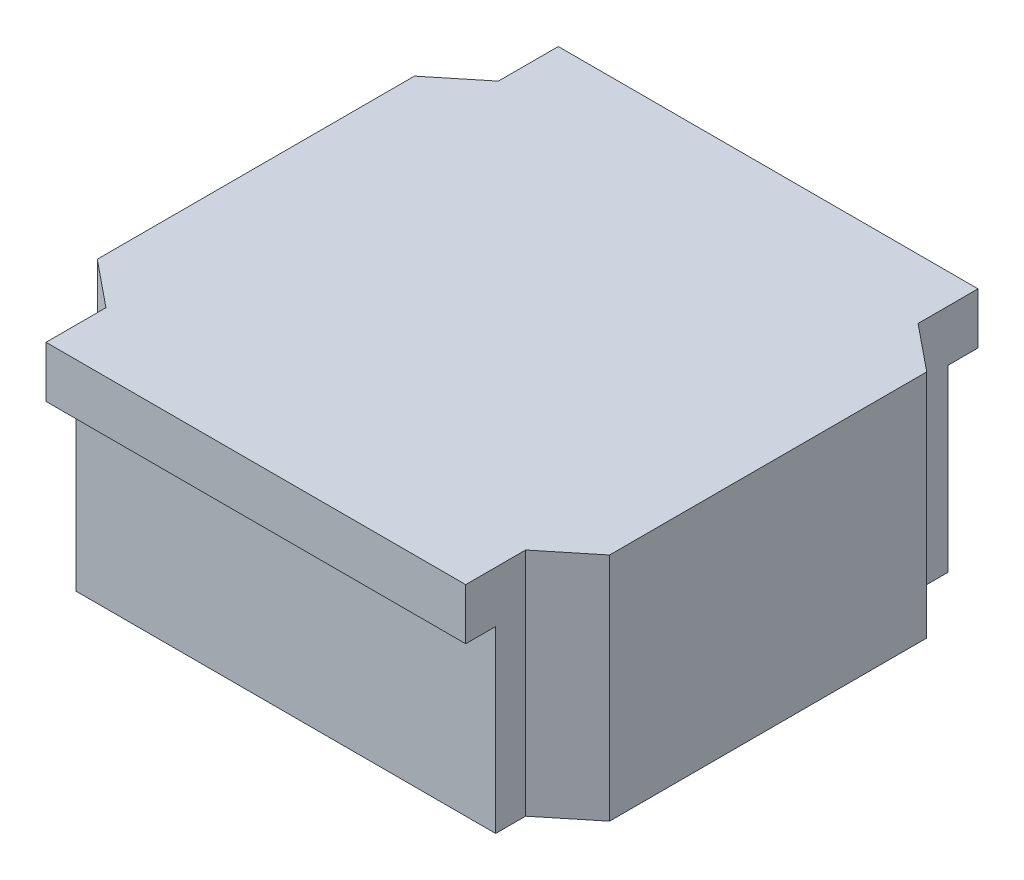
ISO-10303-21;
HEADER;
FILE_DESCRIPTION(('STEP AP214'),'2;1');
FILE_NAME('part.step','',(''),(''),'','','');
FILE_SCHEMA(('AUTOMOTIVE_DESIGN { 1 0 10303 214 1 1 1 1 }'));
ENDSEC;
DATA;
#1=APPLICATION_CONTEXT('core data for automotive mechanical design processes');
#2=APPLICATION_PROTOCOL_DEFINITION('international standard','automotive_design',2000,#1);
#3=PRODUCT_CONTEXT('',#1,'mechanical');
#4=PRODUCT('Part','Part','',(#3));
#5=PRODUCT_RELATED_PRODUCT_CATEGORY('part','',(#4));
#6=PRODUCT_DEFINITION_FORMATION('','',#4);
#7=PRODUCT_DEFINITION_CONTEXT('part definition',#1,'design');
#8=PRODUCT_DEFINITION('design','',#6,#7);
#9=PRODUCT_DEFINITION_SHAPE('','',#8);
#10=(LENGTH_UNIT() NAMED_UNIT(*) SI_UNIT(.MILLI.,.METRE.));
#11=(NAMED_UNIT(*) PLANE_ANGLE_UNIT() SI_UNIT($,.RADIAN.));
#12=(NAMED_UNIT(*) SI_UNIT($,.STERADIAN.) SOLID_ANGLE_UNIT());
#13=UNCERTAINTY_MEASURE_WITH_UNIT(LENGTH_MEASURE(1.E-05),#10,'distance_accuracy_value','');
#14=(GEOMETRIC_REPRESENTATION_CONTEXT(3) GLOBAL_UNCERTAINTY_ASSIGNED_CONTEXT((#13)) GLOBAL_UNIT_ASSIGNED_CONTEXT((#10,
#11,#12)) REPRESENTATION_CONTEXT('',''));
#15=CARTESIAN_POINT('',(0.,0.,0.));
#16=DIRECTION('',(0.,0.,1.));
#17=DIRECTION('',(1.,0.,0.));
#18=AXIS2_PLACEMENT_3D('',#15,#16,#17);
#19=CARTESIAN_POINT('',(0.9614537832608,7.75,-16.78101088067));
#20=DIRECTION('',(1.,0.,0.));
#21=DIRECTION('',(0.,0.,1.));
#22=AXIS2_PLACEMENT_3D('',#19,#20,#21);
#23=PLANE('',#22);
#24=DIRECTION('',(0.,0.,1.));
#25=VECTOR('',#24,1.);
#26=CARTESIAN_POINT('',(0.9614537832608,7.75,-16.547005440335));
#27=LINE('',#26,#25);
#28=CARTESIAN_POINT('',(0.96145378326085,7.75,-16.78101088067));
#29=VERTEX_POINT('',#28);
#30=CARTESIAN_POINT('',(0.96145378326085,7.75,-16.313));
#31=VERTEX_POINT('',#30);
#32=EDGE_CURVE('E248',#29,#31,#27,.T.);
#33=ORIENTED_EDGE('',*,*,#32,.F.);
#34=DIRECTION('',(0.,-1.,0.));
#35=VECTOR('',#34,1.);
#36=CARTESIAN_POINT('',(0.9614537832608,6.85,-16.78101088067));
#37=LINE('',#36,#35);
#38=CARTESIAN_POINT('',(0.9614537832608,5.95,-16.7810108806722));
#39=VERTEX_POINT('',#38);
#40=EDGE_CURVE('E159',#29,#39,#37,.T.);
#41=ORIENTED_EDGE('',*,*,#40,.T.);
#42=DIRECTION('',(0.,0.,-1.));
#43=VECTOR('',#42,1.);
#44=CARTESIAN_POINT('',(0.9614537832608,5.95,-16.547005440335));
#45=LINE('',#44,#43);
#46=CARTESIAN_POINT('',(0.96145378326085,5.95,-16.5470054403375));
#47=VERTEX_POINT('',#46);
#48=EDGE_CURVE('E251',#47,#39,#45,.T.);
#49=ORIENTED_EDGE('',*,*,#48,.F.);
#50=DIRECTION('',(0.,-1.,0.));
#51=VECTOR('',#50,1.);
#52=CARTESIAN_POINT('',(0.9614537832608,6.65,-16.54700544034));
#53=LINE('',#52,#51);
#54=CARTESIAN_POINT('',(0.9614537832608,7.35,-16.5470054403362));
#55=VERTEX_POINT('',#54);
#56=EDGE_CURVE('E221',#55,#47,#53,.T.);
#57=ORIENTED_EDGE('',*,*,#56,.F.);
#58=DIRECTION('',(0.,0.,-1.));
#59=VECTOR('',#58,1.);
#60=CARTESIAN_POINT('',(0.9614537832608,7.35,-16.547005440335));
#61=LINE('',#60,#59);
#62=CARTESIAN_POINT('',(0.9614537832608,7.35,-16.313));
#63=VERTEX_POINT('',#62);
#64=EDGE_CURVE('E252',#63,#55,#61,.T.);
#65=ORIENTED_EDGE('',*,*,#64,.F.);
#66=DIRECTION('',(0.,-1.,0.));
#67=VECTOR('',#66,1.);
#68=CARTESIAN_POINT('',(0.9614537832608,6.85,-16.313));
#69=LINE('',#68,#67);
#70=EDGE_CURVE('E166',#31,#63,#69,.T.);
#71=ORIENTED_EDGE('',*,*,#70,.F.);
#72=EDGE_LOOP('',(#33,#41,#49,#57,#65,#71));
#73=FACE_BOUND('',#72,.T.);
#74=ADVANCED_FACE('F17',(#73),#23,.F.);
#75=CARTESIAN_POINT('',(0.9614537832608,7.75,-20.313));
#76=DIRECTION('',(1.,0.,0.));
#77=DIRECTION('',(0.,0.,1.));
#78=AXIS2_PLACEMENT_3D('',#75,#76,#77);
#79=PLANE('',#78);
#80=DIRECTION('',(0.,1.,0.));
#81=VECTOR('',#80,1.);
#82=CARTESIAN_POINT('',(0.9614537832608,6.85,-20.313));
#83=LINE('',#82,#81);
#84=CARTESIAN_POINT('',(0.9614537832608,7.35,-20.313));
#85=VERTEX_POINT('',#84);
#86=CARTESIAN_POINT('',(0.96145378326085,7.75,-20.313));
#87=VERTEX_POINT('',#86);
#88=EDGE_CURVE('E241',#85,#87,#83,.T.);
#89=ORIENTED_EDGE('',*,*,#88,.F.);
#90=DIRECTION('',(0.,0.,-1.));
#91=VECTOR('',#90,1.);
#92=CARTESIAN_POINT('',(0.9614537832608,7.35,-20.078994559665));
#93=LINE('',#92,#91);
#94=CARTESIAN_POINT('',(0.9614537832608,7.35,-20.0789945596637));
#95=VERTEX_POINT('',#94);
#96=EDGE_CURVE('E165',#95,#85,#93,.T.);
#97=ORIENTED_EDGE('',*,*,#96,.F.);
#98=DIRECTION('',(0.,1.,0.));
#99=VECTOR('',#98,1.);
#100=CARTESIAN_POINT('',(0.9614537832608,6.65,-20.07899455966));
#101=LINE('',#100,#99);
#102=CARTESIAN_POINT('',(0.96145378326085,5.95,-20.0789945596625));
#103=VERTEX_POINT('',#102);
#104=EDGE_CURVE('E224',#103,#95,#101,.T.);
#105=ORIENTED_EDGE('',*,*,#104,.F.);
#106=DIRECTION('',(0.,0.,-1.));
#107=VECTOR('',#106,1.);
#108=CARTESIAN_POINT('',(0.9614537832608,5.95,-20.078994559665));
#109=LINE('',#108,#107);
#110=CARTESIAN_POINT('',(0.9614537832608,5.95,-19.8449891193277));
#111=VERTEX_POINT('',#110);
#112=EDGE_CURVE('E163',#111,#103,#109,.T.);
#113=ORIENTED_EDGE('',*,*,#112,.F.);
#114=DIRECTION('',(0.,1.,0.));
#115=VECTOR('',#114,1.);
#116=CARTESIAN_POINT('',(0.9614537832608,6.85,-19.84498911933));
#117=LINE('',#116,#115);
#118=CARTESIAN_POINT('',(0.96145378326085,7.75,-19.84498911933));
#119=VERTEX_POINT('',#118);
#120=EDGE_CURVE('E146',#111,#119,#117,.T.);
#121=ORIENTED_EDGE('',*,*,#120,.T.);
#122=DIRECTION('',(0.,0.,1.));
#123=VECTOR('',#122,1.);
#124=CARTESIAN_POINT('',(0.9614537832608,7.75,-20.078994559665));
#125=LINE('',#124,#123);
#126=EDGE_CURVE('E173',#87,#119,#125,.T.);
#127=ORIENTED_EDGE('',*,*,#126,.F.);
#128=EDGE_LOOP('',(#89,#97,#105,#113,#121,#127));
#129=FACE_BOUND('',#128,.T.);
#130=ADVANCED_FACE('F301',(#129),#79,.F.);
#131=CARTESIAN_POINT('',(4.238546216739,7.75,-19.84498911933));
#132=DIRECTION('',(-1.,0.,0.));
#133=DIRECTION('',(0.,0.,-1.));
#134=AXIS2_PLACEMENT_3D('',#131,#132,#133);
#135=PLANE('',#134);
#136=DIRECTION('',(0.,0.,-1.));
#137=VECTOR('',#136,1.);
#138=CARTESIAN_POINT('',(4.238546216739,7.75,-20.078994559665));
#139=LINE('',#138,#137);
#140=CARTESIAN_POINT('',(4.238546216739,7.75,-19.84498911933));
#141=VERTEX_POINT('',#140);
#142=CARTESIAN_POINT('',(4.238546216739,7.75,-20.313));
#143=VERTEX_POINT('',#142);
#144=EDGE_CURVE('E172',#141,#143,#139,.T.);
#145=ORIENTED_EDGE('',*,*,#144,.F.);
#146=DIRECTION('',(0.,-1.,0.));
#147=VECTOR('',#146,1.);
#148=CARTESIAN_POINT('',(4.238546216739,6.85,-19.84498911933));
#149=LINE('',#148,#147);
#150=CARTESIAN_POINT('',(4.238546216739,5.95,-19.8449891193278));
#151=VERTEX_POINT('',#150);
#152=EDGE_CURVE('E174',#141,#151,#149,.T.);
#153=ORIENTED_EDGE('',*,*,#152,.T.);
#154=DIRECTION('',(0.,0.,1.));
#155=VECTOR('',#154,1.);
#156=CARTESIAN_POINT('',(4.238546216739,5.95,-20.078994559665));
#157=LINE('',#156,#155);
#158=CARTESIAN_POINT('',(4.238546216739,5.95,-20.0789945596625));
#159=VERTEX_POINT('',#158);
#160=EDGE_CURVE('E170',#159,#151,#157,.T.);
#161=ORIENTED_EDGE('',*,*,#160,.F.);
#162=DIRECTION('',(0.,-1.,0.));
#163=VECTOR('',#162,1.);
#164=CARTESIAN_POINT('',(4.238546216739,6.65,-20.07899455966));
#165=LINE('',#164,#163);
#166=CARTESIAN_POINT('',(4.238546216739,7.35,-20.0789945596625));
#167=VERTEX_POINT('',#166);
#168=EDGE_CURVE('E227',#167,#159,#165,.T.);
#169=ORIENTED_EDGE('',*,*,#168,.F.);
#170=DIRECTION('',(0.,0.,1.));
#171=VECTOR('',#170,1.);
#172=CARTESIAN_POINT('',(4.238546216739,7.35,-18.313));
#173=LINE('',#172,#171);
#174=CARTESIAN_POINT('',(4.238546216739,7.35,-20.313));
#175=VERTEX_POINT('',#174);
#176=EDGE_CURVE('E178',#175,#167,#173,.T.);
#177=ORIENTED_EDGE('',*,*,#176,.F.);
#178=DIRECTION('',(0.,-1.,0.));
#179=VECTOR('',#178,1.);
#180=CARTESIAN_POINT('',(4.238546216739,6.85,-20.313));
#181=LINE('',#180,#179);
#182=EDGE_CURVE('E190',#143,#175,#181,.T.);
#183=ORIENTED_EDGE('',*,*,#182,.F.);
#184=EDGE_LOOP('',(#145,#153,#161,#169,#177,#183));
#185=FACE_BOUND('',#184,.T.);
#186=ADVANCED_FACE('F294',(#185),#135,.F.);
#187=CARTESIAN_POINT('',(4.238546216739,7.75,-16.313));
#188=DIRECTION('',(-1.,0.,0.));
#189=DIRECTION('',(0.,0.,-1.));
#190=AXIS2_PLACEMENT_3D('',#187,#188,#189);
#191=PLANE('',#190);
#192=DIRECTION('',(0.,1.,0.));
#193=VECTOR('',#192,1.);
#194=CARTESIAN_POINT('',(4.238546216739,6.85,-16.313));
#195=LINE('',#194,#193);
#196=CARTESIAN_POINT('',(4.238546216739,7.35,-16.313));
#197=VERTEX_POINT('',#196);
#198=CARTESIAN_POINT('',(4.238546216739,7.75,-16.313));
#199=VERTEX_POINT('',#198);
#200=EDGE_CURVE('E232',#197,#199,#195,.T.);
#201=ORIENTED_EDGE('',*,*,#200,.F.);
#202=DIRECTION('',(0.,0.,1.));
#203=VECTOR('',#202,1.);
#204=CARTESIAN_POINT('',(4.238546216739,7.35,-16.547005440335));
#205=LINE('',#204,#203);
#206=CARTESIAN_POINT('',(4.238546216739,7.35,-16.5470054403363));
#207=VERTEX_POINT('',#206);
#208=EDGE_CURVE('E189',#207,#197,#205,.T.);
#209=ORIENTED_EDGE('',*,*,#208,.F.);
#210=DIRECTION('',(0.,1.,0.));
#211=VECTOR('',#210,1.);
#212=CARTESIAN_POINT('',(4.238546216739,6.65,-16.54700544034));
#213=LINE('',#212,#211);
#214=CARTESIAN_POINT('',(4.238546216739,5.95,-16.5470054403375));
#215=VERTEX_POINT('',#214);
#216=EDGE_CURVE('E218',#215,#207,#213,.T.);
#217=ORIENTED_EDGE('',*,*,#216,.F.);
#218=DIRECTION('',(0.,0.,1.));
#219=VECTOR('',#218,1.);
#220=CARTESIAN_POINT('',(4.238546216739,5.95,-16.547005440335));
#221=LINE('',#220,#219);
#222=CARTESIAN_POINT('',(4.238546216739,5.95,-16.7810108806722));
#223=VERTEX_POINT('',#222);
#224=EDGE_CURVE('E187',#223,#215,#221,.T.);
#225=ORIENTED_EDGE('',*,*,#224,.F.);
#226=DIRECTION('',(0.,1.,0.));
#227=VECTOR('',#226,1.);
#228=CARTESIAN_POINT('',(4.238546216739,6.85,-16.78101088067));
#229=LINE('',#228,#227);
#230=CARTESIAN_POINT('',(4.238546216739,7.75,-16.78101088067));
#231=VERTEX_POINT('',#230);
#232=EDGE_CURVE('E191',#223,#231,#229,.T.);
#233=ORIENTED_EDGE('',*,*,#232,.T.);
#234=DIRECTION('',(0.,0.,-1.));
#235=VECTOR('',#234,1.);
#236=CARTESIAN_POINT('',(4.238546216739,7.75,-16.547005440335));
#237=LINE('',#236,#235);
#238=EDGE_CURVE('E230',#199,#231,#237,.T.);
#239=ORIENTED_EDGE('',*,*,#238,.F.);
#240=EDGE_LOOP('',(#201,#209,#217,#225,#233,#239));
#241=FACE_BOUND('',#240,.T.);
#242=ADVANCED_FACE('F278',(#241),#191,.F.);
#243=CARTESIAN_POINT('',(0.9614537832608,7.35,-20.07899455966));
#244=DIRECTION('',(0.,0.,-1.));
#245=DIRECTION('',(1.,0.,0.));
#246=AXIS2_PLACEMENT_3D('',#243,#244,#245);
#247=PLANE('',#246);
#248=DIRECTION('',(1.,0.,0.));
#249=VECTOR('',#248,1.);
#250=CARTESIAN_POINT('',(2.6,5.95,-20.07899455966));
#251=LINE('',#250,#249);
#252=EDGE_CURVE('E148',#103,#159,#251,.T.);
#253=ORIENTED_EDGE('',*,*,#252,.F.);
#254=ORIENTED_EDGE('',*,*,#104,.T.);
#255=DIRECTION('',(-1.,0.,0.));
#256=VECTOR('',#255,1.);
#257=CARTESIAN_POINT('',(2.5999999999999,7.35,-20.078994559665));
#258=LINE('',#257,#256);
#259=EDGE_CURVE('E212',#167,#95,#258,.T.);
#260=ORIENTED_EDGE('',*,*,#259,.F.);
#261=ORIENTED_EDGE('',*,*,#168,.T.);
#262=EDGE_LOOP('',(#253,#254,#260,#261));
#263=FACE_BOUND('',#262,.T.);
#264=ADVANCED_FACE('F305',(#263),#247,.T.);
#265=CARTESIAN_POINT('',(4.238546216739,7.35,-16.54700544034));
#266=DIRECTION('',(0.,0.,1.));
#267=DIRECTION('',(-1.,0.,0.));
#268=AXIS2_PLACEMENT_3D('',#265,#266,#267);
#269=PLANE('',#268);
#270=DIRECTION('',(-1.,0.,0.));
#271=VECTOR('',#270,1.);
#272=CARTESIAN_POINT('',(2.6,5.95,-16.54700544034));
#273=LINE('',#272,#271);
#274=EDGE_CURVE('E195',#215,#47,#273,.T.);
#275=ORIENTED_EDGE('',*,*,#274,.F.);
#276=ORIENTED_EDGE('',*,*,#216,.T.);
#277=DIRECTION('',(1.,0.,0.));
#278=VECTOR('',#277,1.);
#279=CARTESIAN_POINT('',(2.5999999999999,7.35,-16.547005440335));
#280=LINE('',#279,#278);
#281=EDGE_CURVE('E161',#55,#207,#280,.T.);
#282=ORIENTED_EDGE('',*,*,#281,.F.);
#283=ORIENTED_EDGE('',*,*,#56,.T.);
#284=EDGE_LOOP('',(#275,#276,#282,#283));
#285=FACE_BOUND('',#284,.T.);
#286=ADVANCED_FACE('F275',(#285),#269,.T.);
#287=CARTESIAN_POINT('',(0.6,7.75,-17.07475129974));
#288=DIRECTION('',(0.630669209650137,0.,-0.776051768891272));
#289=DIRECTION('',(0.776051768891271,0.,0.630669209650137));
#290=AXIS2_PLACEMENT_3D('',#287,#288,#289);
#291=PLANE('',#290);
#292=DIRECTION('',(0.,1.,0.));
#293=VECTOR('',#292,1.);
#294=CARTESIAN_POINT('',(0.6,6.85,-17.07475129974));
#295=LINE('',#294,#293);
#296=CARTESIAN_POINT('',(0.6,5.95,-17.0747512997398));
#297=VERTEX_POINT('',#296);
#298=CARTESIAN_POINT('',(0.6,7.75,-17.074751299739));
#299=VERTEX_POINT('',#298);
#300=EDGE_CURVE('E140',#297,#299,#295,.T.);
#301=ORIENTED_EDGE('',*,*,#300,.F.);
#302=DIRECTION('',(-0.776051768896524,0.,-0.630669209643673));
#303=VECTOR('',#302,1.);
#304=CARTESIAN_POINT('',(0.961453783261,5.95,-16.7810108806743));
#305=LINE('',#304,#303);
#306=EDGE_CURVE('E151',#39,#297,#305,.T.);
#307=ORIENTED_EDGE('',*,*,#306,.F.);
#308=ORIENTED_EDGE('',*,*,#40,.F.);
#309=DIRECTION('',(0.776051768891272,0.,0.630669209650137));
#310=VECTOR('',#309,1.);
#311=CARTESIAN_POINT('',(0.7807268916304,7.75,-16.927881090205));
#312=LINE('',#311,#310);
#313=EDGE_CURVE('E169',#299,#29,#312,.T.);
#314=ORIENTED_EDGE('',*,*,#313,.F.);
#315=EDGE_LOOP('',(#301,#307,#308,#314));
#316=FACE_BOUND('',#315,.T.);
#317=ADVANCED_FACE('F260',(#316),#291,.F.);
#318=CARTESIAN_POINT('',(0.9614537832608,7.75,-19.84498911933));
#319=DIRECTION('',(0.630669209650137,0.,0.776051768891272));
#320=DIRECTION('',(-0.776051768891271,0.,0.630669209650137));
#321=AXIS2_PLACEMENT_3D('',#318,#319,#320);
#322=PLANE('',#321);
#323=ORIENTED_EDGE('',*,*,#120,.F.);
#324=DIRECTION('',(0.776051768896528,0.,-0.630669209643669));
#325=VECTOR('',#324,1.);
#326=CARTESIAN_POINT('',(0.6,5.95,-19.5512487002605));
#327=LINE('',#326,#325);
#328=CARTESIAN_POINT('',(0.6,5.95,-19.5512487002602));
#329=VERTEX_POINT('',#328);
#330=EDGE_CURVE('E21',#329,#111,#327,.T.);
#331=ORIENTED_EDGE('',*,*,#330,.F.);
#332=DIRECTION('',(0.,-1.,0.));
#333=VECTOR('',#332,1.);
#334=CARTESIAN_POINT('',(0.6,6.85,-19.55124870026));
#335=LINE('',#334,#333);
#336=CARTESIAN_POINT('',(0.6,7.75,-19.551248700261));
#337=VERTEX_POINT('',#336);
#338=EDGE_CURVE('E129',#337,#329,#335,.T.);
#339=ORIENTED_EDGE('',*,*,#338,.F.);
#340=DIRECTION('',(-0.776051768891272,0.,0.630669209650137));
#341=VECTOR('',#340,1.);
#342=CARTESIAN_POINT('',(0.7807268916304,7.75,-19.698118909795));
#343=LINE('',#342,#341);
#344=EDGE_CURVE('E168',#119,#337,#343,.T.);
#345=ORIENTED_EDGE('',*,*,#344,.F.);
#346=EDGE_LOOP('',(#323,#331,#339,#345));
#347=FACE_BOUND('',#346,.T.);
#348=ADVANCED_FACE('F144',(#347),#322,.F.);
#349=CARTESIAN_POINT('',(0.9614537832608,7.35,-20.313));
#350=DIRECTION('',(0.,-1.,0.));
#351=DIRECTION('',(1.,0.,0.));
#352=AXIS2_PLACEMENT_3D('',#349,#350,#351);
#353=PLANE('',#352);
#354=DIRECTION('',(-1.,0.,0.));
#355=VECTOR('',#354,1.);
#356=CARTESIAN_POINT('',(2.5999999999999,7.35,-20.313));
#357=LINE('',#356,#355);
#358=EDGE_CURVE('E152',#175,#85,#357,.T.);
#359=ORIENTED_EDGE('',*,*,#358,.F.);
#360=ORIENTED_EDGE('',*,*,#176,.T.);
#361=ORIENTED_EDGE('',*,*,#259,.T.);
#362=ORIENTED_EDGE('',*,*,#96,.T.);
#363=EDGE_LOOP('',(#359,#360,#361,#362));
#364=FACE_BOUND('',#363,.T.);
#365=ADVANCED_FACE('F307',(#364),#353,.T.);
#366=CARTESIAN_POINT('',(4.6,7.75,-19.55124870026));
#367=DIRECTION('',(-0.630669209649926,0.,0.776051768891443));
#368=DIRECTION('',(-0.776051768891443,0.,-0.630669209649926));
#369=AXIS2_PLACEMENT_3D('',#366,#367,#368);
#370=PLANE('',#369);
#371=DIRECTION('',(0.,1.,0.));
#372=VECTOR('',#371,1.);
#373=CARTESIAN_POINT('',(4.6,6.85,-19.55124870026));
#374=LINE('',#373,#372);
#375=CARTESIAN_POINT('',(4.6,5.95,-19.5512487002602));
#376=VERTEX_POINT('',#375);
#377=CARTESIAN_POINT('',(4.6,7.75,-19.551248700261));
#378=VERTEX_POINT('',#377);
#379=EDGE_CURVE('E155',#376,#378,#374,.T.);
#380=ORIENTED_EDGE('',*,*,#379,.F.);
#381=DIRECTION('',(0.776051768896528,0.,0.630669209643669));
#382=VECTOR('',#381,1.);
#383=CARTESIAN_POINT('',(4.238546216739,5.95,-19.8449891193257));
#384=LINE('',#383,#382);
#385=EDGE_CURVE('E198',#151,#376,#384,.T.);
#386=ORIENTED_EDGE('',*,*,#385,.F.);
#387=ORIENTED_EDGE('',*,*,#152,.F.);
#388=DIRECTION('',(-0.776051768891443,0.,-0.630669209649926));
#389=VECTOR('',#388,1.);
#390=CARTESIAN_POINT('',(4.4192731083695,7.75,-19.698118909795));
#391=LINE('',#390,#389);
#392=EDGE_CURVE('E177',#378,#141,#391,.T.);
#393=ORIENTED_EDGE('',*,*,#392,.F.);
#394=EDGE_LOOP('',(#380,#386,#387,#393));
#395=FACE_BOUND('',#394,.T.);
#396=ADVANCED_FACE('F292',(#395),#370,.F.);
#397=CARTESIAN_POINT('',(4.238546216739,7.75,-16.78101088067));
#398=DIRECTION('',(-0.630669209649926,0.,-0.776051768891443));
#399=DIRECTION('',(0.776051768891443,0.,-0.630669209649926));
#400=AXIS2_PLACEMENT_3D('',#397,#398,#399);
#401=PLANE('',#400);
#402=ORIENTED_EDGE('',*,*,#232,.F.);
#403=DIRECTION('',(-0.776051768896525,0.,0.630669209643673));
#404=VECTOR('',#403,1.);
#405=CARTESIAN_POINT('',(4.6,5.95,-17.0747512997395));
#406=LINE('',#405,#404);
#407=CARTESIAN_POINT('',(4.6,5.95,-17.0747512997398));
#408=VERTEX_POINT('',#407);
#409=EDGE_CURVE('E196',#408,#223,#406,.T.);
#410=ORIENTED_EDGE('',*,*,#409,.F.);
#411=DIRECTION('',(0.,-1.,0.));
#412=VECTOR('',#411,1.);
#413=CARTESIAN_POINT('',(4.6,6.85,-17.07475129974));
#414=LINE('',#413,#412);
#415=CARTESIAN_POINT('',(4.6,7.75,-17.074751299739));
#416=VERTEX_POINT('',#415);
#417=EDGE_CURVE('E183',#416,#408,#414,.T.);
#418=ORIENTED_EDGE('',*,*,#417,.F.);
#419=DIRECTION('',(0.776051768891443,0.,-0.630669209649926));
#420=VECTOR('',#419,1.);
#421=CARTESIAN_POINT('',(4.4192731083695,7.75,-16.927881090205));
#422=LINE('',#421,#420);
#423=EDGE_CURVE('E36',#231,#416,#422,.T.);
#424=ORIENTED_EDGE('',*,*,#423,.F.);
#425=EDGE_LOOP('',(#402,#410,#418,#424));
#426=FACE_BOUND('',#425,.T.);
#427=ADVANCED_FACE('F283',(#426),#401,.F.);
#428=CARTESIAN_POINT('',(0.6,5.95,-20.07899455966));
#429=DIRECTION('',(0.,-1.,0.));
#430=DIRECTION('',(1.,0.,0.));
#431=AXIS2_PLACEMENT_3D('',#428,#429,#430);
#432=PLANE('',#431);
#433=ORIENTED_EDGE('',*,*,#48,.T.);
#434=ORIENTED_EDGE('',*,*,#306,.T.);
#435=DIRECTION('',(0.,0.,1.));
#436=VECTOR('',#435,1.);
#437=CARTESIAN_POINT('',(0.6,5.95,-18.313));
#438=LINE('',#437,#436);
#439=EDGE_CURVE('E134',#329,#297,#438,.T.);
#440=ORIENTED_EDGE('',*,*,#439,.F.);
#441=ORIENTED_EDGE('',*,*,#330,.T.);
#442=ORIENTED_EDGE('',*,*,#112,.T.);
#443=ORIENTED_EDGE('',*,*,#252,.T.);
#444=ORIENTED_EDGE('',*,*,#160,.T.);
#445=ORIENTED_EDGE('',*,*,#385,.T.);
#446=DIRECTION('',(0.,0.,-1.));
#447=VECTOR('',#446,1.);
#448=CARTESIAN_POINT('',(4.6,5.95,-18.313));
#449=LINE('',#448,#447);
#450=EDGE_CURVE('E179',#408,#376,#449,.T.);
#451=ORIENTED_EDGE('',*,*,#450,.F.);
#452=ORIENTED_EDGE('',*,*,#409,.T.);
#453=ORIENTED_EDGE('',*,*,#224,.T.);
#454=ORIENTED_EDGE('',*,*,#274,.T.);
#455=EDGE_LOOP('',(#433,#434,#440,#441,#442,#443,#444,#445,#451,#452,#453,#454));
#456=FACE_BOUND('',#455,.T.);
#457=ADVANCED_FACE('F149',(#456),#432,.T.);
#458=CARTESIAN_POINT('',(0.9614537832608,7.35,-20.313));
#459=DIRECTION('',(0.,-1.,0.));
#460=DIRECTION('',(1.,0.,0.));
#461=AXIS2_PLACEMENT_3D('',#458,#459,#460);
#462=PLANE('',#461);
#463=DIRECTION('',(1.,0.,0.));
#464=VECTOR('',#463,1.);
#465=CARTESIAN_POINT('',(2.5999999999999,7.35,-16.313));
#466=LINE('',#465,#464);
#467=EDGE_CURVE('E182',#63,#197,#466,.T.);
#468=ORIENTED_EDGE('',*,*,#467,.F.);
#469=ORIENTED_EDGE('',*,*,#64,.T.);
#470=ORIENTED_EDGE('',*,*,#281,.T.);
#471=ORIENTED_EDGE('',*,*,#208,.T.);
#472=EDGE_LOOP('',(#468,#469,#470,#471));
#473=FACE_BOUND('',#472,.T.);
#474=ADVANCED_FACE('F273',(#473),#462,.T.);
#475=CARTESIAN_POINT('',(0.6,7.75,-17.07475129974));
#476=DIRECTION('',(-1.,0.,0.));
#477=DIRECTION('',(0.,0.,-1.));
#478=AXIS2_PLACEMENT_3D('',#475,#476,#477);
#479=PLANE('',#478);
#480=ORIENTED_EDGE('',*,*,#338,.T.);
#481=ORIENTED_EDGE('',*,*,#439,.T.);
#482=ORIENTED_EDGE('',*,*,#300,.T.);
#483=DIRECTION('',(0.,0.,-1.));
#484=VECTOR('',#483,1.);
#485=CARTESIAN_POINT('',(0.6,7.75,-18.313));
#486=LINE('',#485,#484);
#487=EDGE_CURVE('E137',#299,#337,#486,.T.);
#488=ORIENTED_EDGE('',*,*,#487,.T.);
#489=EDGE_LOOP('',(#480,#481,#482,#488));
#490=FACE_BOUND('',#489,.T.);
#491=ADVANCED_FACE('F131',(#490),#479,.T.);
#492=CARTESIAN_POINT('',(0.9614537832608,7.75,-20.313));
#493=DIRECTION('',(0.,0.,-1.));
#494=DIRECTION('',(1.,0.,0.));
#495=AXIS2_PLACEMENT_3D('',#492,#493,#494);
#496=PLANE('',#495);
#497=ORIENTED_EDGE('',*,*,#88,.T.);
#498=DIRECTION('',(1.,0.,0.));
#499=VECTOR('',#498,1.);
#500=CARTESIAN_POINT('',(2.6,7.75,-20.313));
#501=LINE('',#500,#499);
#502=EDGE_CURVE('E262',#87,#143,#501,.T.);
#503=ORIENTED_EDGE('',*,*,#502,.T.);
#504=ORIENTED_EDGE('',*,*,#182,.T.);
#505=ORIENTED_EDGE('',*,*,#358,.T.);
#506=EDGE_LOOP('',(#497,#503,#504,#505));
#507=FACE_BOUND('',#506,.T.);
#508=ADVANCED_FACE('F298',(#507),#496,.T.);
#509=CARTESIAN_POINT('',(4.6,7.75,-19.55124870026));
#510=DIRECTION('',(1.,0.,0.));
#511=DIRECTION('',(0.,0.,1.));
#512=AXIS2_PLACEMENT_3D('',#509,#510,#511);
#513=PLANE('',#512);
#514=ORIENTED_EDGE('',*,*,#417,.T.);
#515=ORIENTED_EDGE('',*,*,#450,.T.);
#516=ORIENTED_EDGE('',*,*,#379,.T.);
#517=DIRECTION('',(0.,0.,1.));
#518=VECTOR('',#517,1.);
#519=CARTESIAN_POINT('',(4.6,7.75,-18.313));
#520=LINE('',#519,#518);
#521=EDGE_CURVE('E27',#378,#416,#520,.T.);
#522=ORIENTED_EDGE('',*,*,#521,.T.);
#523=EDGE_LOOP('',(#514,#515,#516,#522));
#524=FACE_BOUND('',#523,.T.);
#525=ADVANCED_FACE('F287',(#524),#513,.T.);
#526=CARTESIAN_POINT('',(4.238546216739,7.75,-16.313));
#527=DIRECTION('',(0.,0.,1.));
#528=DIRECTION('',(-1.,0.,0.));
#529=AXIS2_PLACEMENT_3D('',#526,#527,#528);
#530=PLANE('',#529);
#531=ORIENTED_EDGE('',*,*,#200,.T.);
#532=DIRECTION('',(-1.,0.,0.));
#533=VECTOR('',#532,1.);
#534=CARTESIAN_POINT('',(2.6,7.75,-16.313));
#535=LINE('',#534,#533);
#536=EDGE_CURVE('E11',#199,#31,#535,.T.);
#537=ORIENTED_EDGE('',*,*,#536,.T.);
#538=ORIENTED_EDGE('',*,*,#70,.T.);
#539=ORIENTED_EDGE('',*,*,#467,.T.);
#540=EDGE_LOOP('',(#531,#537,#538,#539));
#541=FACE_BOUND('',#540,.T.);
#542=ADVANCED_FACE('F281',(#541),#530,.T.);
#543=CARTESIAN_POINT('',(0.6,7.75,-20.313));
#544=DIRECTION('',(0.,-1.,0.));
#545=DIRECTION('',(1.,0.,0.));
#546=AXIS2_PLACEMENT_3D('',#543,#544,#545);
#547=PLANE('',#546);
#548=ORIENTED_EDGE('',*,*,#536,.F.);
#549=ORIENTED_EDGE('',*,*,#238,.T.);
#550=ORIENTED_EDGE('',*,*,#423,.T.);
#551=ORIENTED_EDGE('',*,*,#521,.F.);
#552=ORIENTED_EDGE('',*,*,#392,.T.);
#553=ORIENTED_EDGE('',*,*,#144,.T.);
#554=ORIENTED_EDGE('',*,*,#502,.F.);
#555=ORIENTED_EDGE('',*,*,#126,.T.);
#556=ORIENTED_EDGE('',*,*,#344,.T.);
#557=ORIENTED_EDGE('',*,*,#487,.F.);
#558=ORIENTED_EDGE('',*,*,#313,.T.);
#559=ORIENTED_EDGE('',*,*,#32,.T.);
#560=EDGE_LOOP('',(#548,#549,#550,#551,#552,#553,#554,#555,#556,#557,#558,#559));
#561=FACE_BOUND('',#560,.T.);
#562=ADVANCED_FACE('F19',(#561),#547,.F.);
#563=CLOSED_SHELL('',(#74,#130,#186,#242,#264,#286,#317,#348,#365,#396,#427,#457,#474,#491,#508,
#525,#542,#562));
#564=MANIFOLD_SOLID_BREP('B1',#563);
#565=ADVANCED_BREP_SHAPE_REPRESENTATION('',(#18,#564),#14);
#566=SHAPE_DEFINITION_REPRESENTATION(#9,#565);
ENDSEC;
END-ISO-10303-21;
